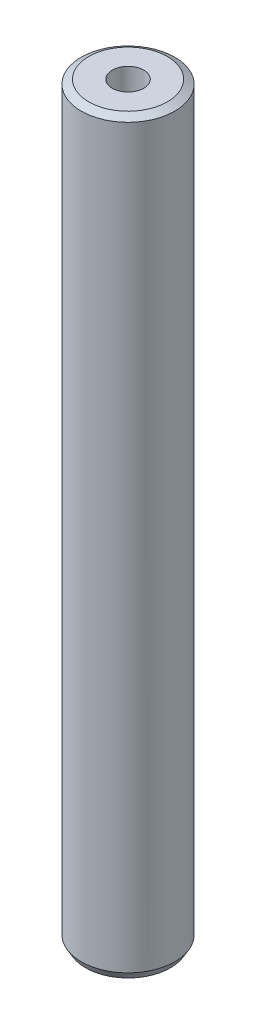
ISO-10303-21;
HEADER;
FILE_DESCRIPTION(('STEP AP214'),'2;1');
FILE_NAME('part.step','',(''),(''),'','','');
FILE_SCHEMA(('AUTOMOTIVE_DESIGN { 1 0 10303 214 1 1 1 1 }'));
ENDSEC;
DATA;
#1=APPLICATION_CONTEXT('core data for automotive mechanical design processes');
#2=APPLICATION_PROTOCOL_DEFINITION('international standard','automotive_design',2000,#1);
#3=PRODUCT_CONTEXT('',#1,'mechanical');
#4=PRODUCT('Part','Part','',(#3));
#5=PRODUCT_RELATED_PRODUCT_CATEGORY('part','',(#4));
#6=PRODUCT_DEFINITION_FORMATION('','',#4);
#7=PRODUCT_DEFINITION_CONTEXT('part definition',#1,'design');
#8=PRODUCT_DEFINITION('design','',#6,#7);
#9=PRODUCT_DEFINITION_SHAPE('','',#8);
#10=(LENGTH_UNIT() NAMED_UNIT(*) SI_UNIT(.MILLI.,.METRE.));
#11=(NAMED_UNIT(*) PLANE_ANGLE_UNIT() SI_UNIT($,.RADIAN.));
#12=(NAMED_UNIT(*) SI_UNIT($,.STERADIAN.) SOLID_ANGLE_UNIT());
#13=UNCERTAINTY_MEASURE_WITH_UNIT(LENGTH_MEASURE(1.E-05),#10,'distance_accuracy_value','');
#14=(GEOMETRIC_REPRESENTATION_CONTEXT(3) GLOBAL_UNCERTAINTY_ASSIGNED_CONTEXT((#13)) GLOBAL_UNIT_ASSIGNED_CONTEXT((#10,
#11,#12)) REPRESENTATION_CONTEXT('',''));
#15=CARTESIAN_POINT('',(0.,0.,0.));
#16=DIRECTION('',(0.,0.,1.));
#17=DIRECTION('',(1.,0.,0.));
#18=AXIS2_PLACEMENT_3D('',#15,#16,#17);
#19=CARTESIAN_POINT('',(0.,600.,0.));
#20=DIRECTION('',(0.,-1.,0.));
#21=DIRECTION('',(0.,0.,-1.));
#22=AXIS2_PLACEMENT_3D('',#19,#20,#21);
#23=CYLINDRICAL_SURFACE('',#22,37.5);
#24=CARTESIAN_POINT('',(0.,596.546221698704,0.));
#25=DIRECTION('',(0.,1.,0.));
#26=DIRECTION('',(0.,0.,1.));
#27=AXIS2_PLACEMENT_3D('',#24,#25,#26);
#28=CIRCLE('',#27,37.5);
#29=CARTESIAN_POINT('',(0.,596.546221698704,-37.5000000000001));
#30=VERTEX_POINT('',#29);
#31=EDGE_CURVE('E50',#30,#30,#28,.F.);
#32=ORIENTED_EDGE('',*,*,#31,.T.);
#33=EDGE_LOOP('',(#32));
#34=FACE_BOUND('',#33,.T.);
#35=CARTESIAN_POINT('',(0.,5.98211949592298,0.));
#36=DIRECTION('',(0.,1.,0.));
#37=DIRECTION('',(0.,0.,1.));
#38=AXIS2_PLACEMENT_3D('',#35,#36,#37);
#39=CIRCLE('',#38,37.5);
#40=CARTESIAN_POINT('',(0.,5.98211949592298,37.5));
#41=VERTEX_POINT('',#40);
#42=EDGE_CURVE('E51',#41,#41,#39,.T.);
#43=ORIENTED_EDGE('',*,*,#42,.T.);
#44=EDGE_LOOP('',(#43));
#45=FACE_BOUND('',#44,.T.);
#46=ADVANCED_FACE('F39',(#34,#45),#23,.T.);
#47=CARTESIAN_POINT('',(0.,600.,0.));
#48=DIRECTION('',(0.,1.,0.));
#49=DIRECTION('',(0.,0.,1.));
#50=AXIS2_PLACEMENT_3D('',#47,#48,#49);
#51=PLANE('',#50);
#52=CARTESIAN_POINT('',(0.,600.,0.));
#53=DIRECTION('',(0.,1.,0.));
#54=DIRECTION('',(0.,0.,1.));
#55=AXIS2_PLACEMENT_3D('',#52,#53,#54);
#56=CIRCLE('',#55,31.5178805040767);
#57=CARTESIAN_POINT('',(0.,600.,-31.5178805040768));
#58=VERTEX_POINT('',#57);
#59=EDGE_CURVE('E54',#58,#58,#56,.T.);
#60=ORIENTED_EDGE('',*,*,#59,.T.);
#61=EDGE_LOOP('',(#60));
#62=FACE_BOUND('',#61,.T.);
#63=CARTESIAN_POINT('',(0.,600.,0.));
#64=DIRECTION('',(0.,1.,0.));
#65=DIRECTION('',(0.,0.,1.));
#66=AXIS2_PLACEMENT_3D('',#63,#64,#65);
#67=CIRCLE('',#66,12.6322290139942);
#68=CARTESIAN_POINT('',(0.,600.,12.6322290139942));
#69=VERTEX_POINT('',#68);
#70=EDGE_CURVE('E58',#69,#69,#67,.T.);
#71=ORIENTED_EDGE('',*,*,#70,.F.);
#72=EDGE_LOOP('',(#71));
#73=FACE_BOUND('',#72,.T.);
#74=ADVANCED_FACE('F69',(#62,#73),#51,.T.);
#75=CARTESIAN_POINT('',(0.,0.,0.));
#76=DIRECTION('',(0.,1.,0.));
#77=DIRECTION('',(0.,0.,1.));
#78=AXIS2_PLACEMENT_3D('',#75,#76,#77);
#79=PLANE('',#78);
#80=CARTESIAN_POINT('',(0.,0.,0.));
#81=DIRECTION('',(0.,1.,0.));
#82=DIRECTION('',(0.,0.,1.));
#83=AXIS2_PLACEMENT_3D('',#80,#81,#82);
#84=CIRCLE('',#83,34.0462216987044);
#85=CARTESIAN_POINT('',(0.,0.,34.0462216987044));
#86=VERTEX_POINT('',#85);
#87=EDGE_CURVE('E10',#86,#86,#84,.F.);
#88=ORIENTED_EDGE('',*,*,#87,.T.);
#89=EDGE_LOOP('',(#88));
#90=FACE_BOUND('',#89,.T.);
#91=CARTESIAN_POINT('',(0.,0.,0.));
#92=DIRECTION('',(0.,1.,0.));
#93=DIRECTION('',(0.,0.,1.));
#94=AXIS2_PLACEMENT_3D('',#91,#92,#93);
#95=CIRCLE('',#94,12.6322290139942);
#96=CARTESIAN_POINT('',(0.,0.,12.6322290139942));
#97=VERTEX_POINT('',#96);
#98=EDGE_CURVE('E63',#97,#97,#95,.T.);
#99=ORIENTED_EDGE('',*,*,#98,.T.);
#100=EDGE_LOOP('',(#99));
#101=FACE_BOUND('',#100,.T.);
#102=ADVANCED_FACE('F75',(#90,#101),#79,.F.);
#103=CARTESIAN_POINT('',(0.,600.,0.));
#104=DIRECTION('',(0.,-1.,0.));
#105=DIRECTION('',(0.,0.,-1.));
#106=AXIS2_PLACEMENT_3D('',#103,#104,#105);
#107=CYLINDRICAL_SURFACE('',#106,12.6322290139942);
#108=ORIENTED_EDGE('',*,*,#70,.T.);
#109=EDGE_LOOP('',(#108));
#110=FACE_BOUND('',#109,.T.);
#111=ORIENTED_EDGE('',*,*,#98,.F.);
#112=EDGE_LOOP('',(#111));
#113=FACE_BOUND('',#112,.T.);
#114=ADVANCED_FACE('F70',(#110,#113),#107,.F.);
#115=CARTESIAN_POINT('',(0.,600.,0.));
#116=DIRECTION('',(0.,-1.,0.));
#117=DIRECTION('',(0.,0.,-1.));
#118=AXIS2_PLACEMENT_3D('',#115,#116,#117);
#119=CONICAL_SURFACE('',#118,31.5178805040767,1.04719755119661);
#120=CARTESIAN_POINT('',(0.,596.546221698704,-37.5000000000001));
#121=CARTESIAN_POINT('',(0.,596.582198556009,-37.4376862552509));
#122=CARTESIAN_POINT('',(0.,596.618175413314,-37.3753725105017));
#123=CARTESIAN_POINT('',(0.,596.690129127925,-37.2507450210033));
#124=CARTESIAN_POINT('',(0.,596.72610598523,-37.1884312762541));
#125=CARTESIAN_POINT('',(0.,596.79805969984,-37.0638037867557));
#126=CARTESIAN_POINT('',(0.,596.834036557146,-37.0014900420065));
#127=CARTESIAN_POINT('',(0.,596.905990271756,-36.8768625525081));
#128=CARTESIAN_POINT('',(0.,596.941967129061,-36.8145488077589));
#129=CARTESIAN_POINT('',(0.,597.013920843671,-36.6899213182605));
#130=CARTESIAN_POINT('',(0.,597.049897700977,-36.6276075735113));
#131=CARTESIAN_POINT('',(0.,597.121851415587,-36.5029800840129));
#132=CARTESIAN_POINT('',(0.,597.157828272892,-36.4406663392637));
#133=CARTESIAN_POINT('',(0.,597.229781987502,-36.3160388497653));
#134=CARTESIAN_POINT('',(0.,597.265758844807,-36.2537251050161));
#135=CARTESIAN_POINT('',(0.,597.337712559418,-36.1290976155177));
#136=CARTESIAN_POINT('',(0.,597.373689416723,-36.0667838707685));
#137=CARTESIAN_POINT('',(0.,597.445643131333,-35.9421563812701));
#138=CARTESIAN_POINT('',(0.,597.481619988638,-35.8798426365209));
#139=CARTESIAN_POINT('',(0.,597.553573703249,-35.7552151470225));
#140=CARTESIAN_POINT('',(0.,597.589550560554,-35.6929014022733));
#141=CARTESIAN_POINT('',(0.,597.661504275164,-35.5682739127749));
#142=CARTESIAN_POINT('',(0.,597.697481132469,-35.5059601680257));
#143=CARTESIAN_POINT('',(0.,597.76943484708,-35.3813326785273));
#144=CARTESIAN_POINT('',(0.,597.805411704385,-35.319018933778));
#145=CARTESIAN_POINT('',(0.,597.877365418995,-35.1943914442796));
#146=CARTESIAN_POINT('',(0.,597.9133422763,-35.1320776995304));
#147=CARTESIAN_POINT('',(0.,597.985295990911,-35.007450210032));
#148=CARTESIAN_POINT('',(0.,598.021272848216,-34.9451364652828));
#149=CARTESIAN_POINT('',(0.,598.093226562826,-34.8205089757844));
#150=CARTESIAN_POINT('',(0.,598.129203420131,-34.7581952310352));
#151=CARTESIAN_POINT('',(0.,598.201157134742,-34.6335677415368));
#152=CARTESIAN_POINT('',(0.,598.237133992047,-34.5712539967876));
#153=CARTESIAN_POINT('',(0.,598.309087706657,-34.4466265072892));
#154=CARTESIAN_POINT('',(0.,598.345064563962,-34.38431276254));
#155=CARTESIAN_POINT('',(0.,598.417018278573,-34.2596852730416));
#156=CARTESIAN_POINT('',(0.,598.452995135878,-34.1973715282924));
#157=CARTESIAN_POINT('',(0.,598.524948850488,-34.072744038794));
#158=CARTESIAN_POINT('',(0.,598.560925707793,-34.0104302940448));
#159=CARTESIAN_POINT('',(0.,598.632879422404,-33.8858028045464));
#160=CARTESIAN_POINT('',(0.,598.668856279709,-33.8234890597972));
#161=CARTESIAN_POINT('',(0.,598.740809994319,-33.6988615702988));
#162=CARTESIAN_POINT('',(0.,598.776786851624,-33.6365478255496));
#163=CARTESIAN_POINT('',(0.,598.848740566235,-33.5119203360512));
#164=CARTESIAN_POINT('',(0.,598.88471742354,-33.449606591302));
#165=CARTESIAN_POINT('',(0.,598.95667113815,-33.3249791018036));
#166=CARTESIAN_POINT('',(0.,598.992647995455,-33.2626653570544));
#167=CARTESIAN_POINT('',(0.,599.064601710066,-33.138037867556));
#168=CARTESIAN_POINT('',(0.,599.100578567371,-33.0757241228068));
#169=CARTESIAN_POINT('',(0.,599.172532281981,-32.9510966333084));
#170=CARTESIAN_POINT('',(0.,599.208509139286,-32.8887828885592));
#171=CARTESIAN_POINT('',(0.,599.280462853897,-32.7641553990608));
#172=CARTESIAN_POINT('',(0.,599.316439711202,-32.7018416543116));
#173=CARTESIAN_POINT('',(0.,599.388393425812,-32.5772141648132));
#174=CARTESIAN_POINT('',(0.,599.424370283117,-32.514900420064));
#175=CARTESIAN_POINT('',(0.,599.496323997728,-32.3902729305656));
#176=CARTESIAN_POINT('',(0.,599.532300855033,-32.3279591858164));
#177=CARTESIAN_POINT('',(0.,599.604254569643,-32.203331696318));
#178=CARTESIAN_POINT('',(0.,599.640231426948,-32.1410179515688));
#179=CARTESIAN_POINT('',(0.,599.712185141559,-32.0163904620704));
#180=CARTESIAN_POINT('',(0.,599.748161998864,-31.9540767173212));
#181=CARTESIAN_POINT('',(0.,599.820115713474,-31.8294492278228));
#182=CARTESIAN_POINT('',(0.,599.856092570779,-31.7671354830736));
#183=CARTESIAN_POINT('',(0.,599.92804628539,-31.6425079935752));
#184=CARTESIAN_POINT('',(0.,599.964023142695,-31.580194248826));
#185=CARTESIAN_POINT('',(0.,600.,-31.5178805040768));
#186=B_SPLINE_CURVE_WITH_KNOTS('',3,(#120,#121,#122,#123,#124,#125,#126,#127,#128,#129,#130,
#131,#132,#133,#134,#135,#136,#137,#138,#139,#140,#141,#142,#143,#144,#145,#146,#147,#148,#149,
#150,#151,#152,#153,#154,#155,#156,#157,#158,#159,#160,#161,#162,#163,#164,#165,#166,#167,#168,
#169,#170,#171,#172,#173,#174,#175,#176,#177,#178,#179,#180,#181,#182,#183,#184,#185),
.UNSPECIFIED.,.F.,.F.,(4,2,2,2,2,2,2,2,2,2,2,2,2,2,2,2,2,2,2,2,2,2,2,2,2,2,2,2,2,2,2,2,4),(0.,
0.215861143830989,0.431722287661977,0.647583431492966,0.863444575323961,1.07930571915495,
1.29516686298594,1.51102800681693,1.72688915064792,1.9427502944789,2.15861143830989,
2.37447258214089,2.59033372597188,2.80619486980287,3.02205601363385,3.23791715746484,
3.45377830129583,3.66963944512682,3.88550058895781,4.1013617327888,4.31722287661979,
4.53308402045078,4.74894516428177,4.96480630811276,5.18066745194375,5.39652859577474,
5.61238973960573,5.82825088343672,6.04411202726771,6.2599731710987,6.47583431492969,
6.69169545876068,6.90755660259167),.UNSPECIFIED.);
#187=EDGE_CURVE('BSEAM81',#30,#58,#186,.T.);
#188=ORIENTED_EDGE('',*,*,#31,.F.);
#189=ORIENTED_EDGE('',*,*,#59,.F.);
#190=ORIENTED_EDGE('',*,*,#187,.T.);
#191=ORIENTED_EDGE('',*,*,#187,.F.);
#192=EDGE_LOOP('',(#188,#190,#189,#191));
#193=FACE_BOUND('',#192,.T.);
#194=ADVANCED_FACE('F81',(#193),#119,.T.);
#195=CARTESIAN_POINT('',(0.,5.98211949592298,0.));
#196=DIRECTION('',(0.,1.,0.));
#197=DIRECTION('',(0.,0.,1.));
#198=AXIS2_PLACEMENT_3D('',#195,#196,#197);
#199=CONICAL_SURFACE('',#198,37.5,0.5235987755983);
#200=ORIENTED_EDGE('',*,*,#87,.F.);
#201=EDGE_LOOP('',(#200));
#202=FACE_BOUND('',#201,.T.);
#203=ORIENTED_EDGE('',*,*,#42,.F.);
#204=EDGE_LOOP('',(#203));
#205=FACE_BOUND('',#204,.T.);
#206=ADVANCED_FACE('F45',(#202,#205),#199,.T.);
#207=CLOSED_SHELL('',(#46,#74,#102,#114,#194,#206));
#208=MANIFOLD_SOLID_BREP('B2',#207);
#209=ADVANCED_BREP_SHAPE_REPRESENTATION('',(#18,#208),#14);
#210=SHAPE_DEFINITION_REPRESENTATION(#9,#209);
ENDSEC;
END-ISO-10303-21;
